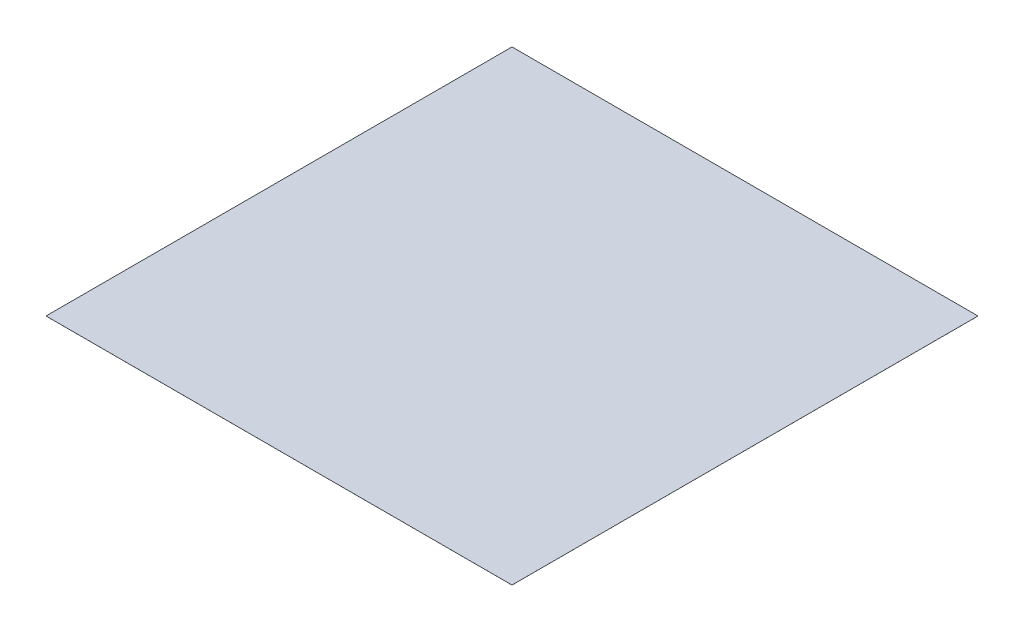
ISO-10303-21;
HEADER;
FILE_DESCRIPTION(('STEP AP214'),'2;1');
FILE_NAME('part.step','',(''),(''),'','','');
FILE_SCHEMA(('AUTOMOTIVE_DESIGN { 1 0 10303 214 1 1 1 1 }'));
ENDSEC;
DATA;
#1=APPLICATION_CONTEXT('core data for automotive mechanical design processes');
#2=APPLICATION_PROTOCOL_DEFINITION('international standard','automotive_design',2000,#1);
#3=PRODUCT_CONTEXT('',#1,'mechanical');
#4=PRODUCT('Part','Part','',(#3));
#5=PRODUCT_RELATED_PRODUCT_CATEGORY('part','',(#4));
#6=PRODUCT_DEFINITION_FORMATION('','',#4);
#7=PRODUCT_DEFINITION_CONTEXT('part definition',#1,'design');
#8=PRODUCT_DEFINITION('design','',#6,#7);
#9=PRODUCT_DEFINITION_SHAPE('','',#8);
#10=(LENGTH_UNIT() NAMED_UNIT(*) SI_UNIT(.MILLI.,.METRE.));
#11=(NAMED_UNIT(*) PLANE_ANGLE_UNIT() SI_UNIT($,.RADIAN.));
#12=(NAMED_UNIT(*) SI_UNIT($,.STERADIAN.) SOLID_ANGLE_UNIT());
#13=UNCERTAINTY_MEASURE_WITH_UNIT(LENGTH_MEASURE(1.E-05),#10,'distance_accuracy_value','');
#14=(GEOMETRIC_REPRESENTATION_CONTEXT(3) GLOBAL_UNCERTAINTY_ASSIGNED_CONTEXT((#13)) GLOBAL_UNIT_ASSIGNED_CONTEXT((#10,
#11,#12)) REPRESENTATION_CONTEXT('',''));
#15=CARTESIAN_POINT('',(0.,0.,0.));
#16=DIRECTION('',(0.,0.,1.));
#17=DIRECTION('',(1.,0.,0.));
#18=AXIS2_PLACEMENT_3D('',#15,#16,#17);
#19=CARTESIAN_POINT('',(125000.,10.,-125000.));
#20=DIRECTION('',(-1.,0.,0.));
#21=DIRECTION('',(0.,0.,1.));
#22=AXIS2_PLACEMENT_3D('',#19,#20,#21);
#23=PLANE('',#22);
#24=DIRECTION('',(0.,0.,-1.));
#25=VECTOR('',#24,1.);
#26=CARTESIAN_POINT('',(125000.,0.,-125000.));
#27=LINE('',#26,#25);
#28=CARTESIAN_POINT('',(125000.,0.,125000.));
#29=VERTEX_POINT('',#28);
#30=CARTESIAN_POINT('',(125000.,0.,-125000.));
#31=VERTEX_POINT('',#30);
#32=EDGE_CURVE('E96',#29,#31,#27,.T.);
#33=ORIENTED_EDGE('',*,*,#32,.T.);
#34=DIRECTION('',(0.,-1.,0.));
#35=VECTOR('',#34,1.);
#36=CARTESIAN_POINT('',(125000.,10.,-125000.));
#37=LINE('',#36,#35);
#38=CARTESIAN_POINT('',(125000.,10.,-125000.));
#39=VERTEX_POINT('',#38);
#40=EDGE_CURVE('E11',#39,#31,#37,.T.);
#41=ORIENTED_EDGE('',*,*,#40,.F.);
#42=DIRECTION('',(0.,0.,-1.));
#43=VECTOR('',#42,1.);
#44=CARTESIAN_POINT('',(125000.,10.,-125000.));
#45=LINE('',#44,#43);
#46=CARTESIAN_POINT('',(125000.,10.,125000.));
#47=VERTEX_POINT('',#46);
#48=EDGE_CURVE('E84',#47,#39,#45,.T.);
#49=ORIENTED_EDGE('',*,*,#48,.F.);
#50=DIRECTION('',(0.,-1.,0.));
#51=VECTOR('',#50,1.);
#52=CARTESIAN_POINT('',(125000.,10.,125000.));
#53=LINE('',#52,#51);
#54=EDGE_CURVE('E92',#47,#29,#53,.T.);
#55=ORIENTED_EDGE('',*,*,#54,.T.);
#56=EDGE_LOOP('',(#33,#41,#49,#55));
#57=FACE_BOUND('',#56,.T.);
#58=ADVANCED_FACE('F33',(#57),#23,.F.);
#59=CARTESIAN_POINT('',(-125000.,10.,-125000.));
#60=DIRECTION('',(0.,0.,1.));
#61=DIRECTION('',(1.,0.,0.));
#62=AXIS2_PLACEMENT_3D('',#59,#60,#61);
#63=PLANE('',#62);
#64=DIRECTION('',(-1.,0.,0.));
#65=VECTOR('',#64,1.);
#66=CARTESIAN_POINT('',(-125000.,0.,-125000.));
#67=LINE('',#66,#65);
#68=CARTESIAN_POINT('',(-125000.,0.,-125000.));
#69=VERTEX_POINT('',#68);
#70=EDGE_CURVE('E88',#31,#69,#67,.T.);
#71=ORIENTED_EDGE('',*,*,#70,.T.);
#72=DIRECTION('',(0.,-1.,0.));
#73=VECTOR('',#72,1.);
#74=CARTESIAN_POINT('',(-125000.,10.,-125000.));
#75=LINE('',#74,#73);
#76=CARTESIAN_POINT('',(-125000.,10.,-125000.));
#77=VERTEX_POINT('',#76);
#78=EDGE_CURVE('E41',#77,#69,#75,.T.);
#79=ORIENTED_EDGE('',*,*,#78,.F.);
#80=DIRECTION('',(-1.,0.,0.));
#81=VECTOR('',#80,1.);
#82=CARTESIAN_POINT('',(-125000.,10.,-125000.));
#83=LINE('',#82,#81);
#84=EDGE_CURVE('E79',#39,#77,#83,.T.);
#85=ORIENTED_EDGE('',*,*,#84,.F.);
#86=ORIENTED_EDGE('',*,*,#40,.T.);
#87=EDGE_LOOP('',(#71,#79,#85,#86));
#88=FACE_BOUND('',#87,.T.);
#89=ADVANCED_FACE('F87',(#88),#63,.F.);
#90=CARTESIAN_POINT('',(-125000.,10.,-125000.));
#91=DIRECTION('',(1.,0.,0.));
#92=DIRECTION('',(0.,0.,-1.));
#93=AXIS2_PLACEMENT_3D('',#90,#91,#92);
#94=PLANE('',#93);
#95=DIRECTION('',(0.,0.,1.));
#96=VECTOR('',#95,1.);
#97=CARTESIAN_POINT('',(-125000.,0.,-125000.));
#98=LINE('',#97,#96);
#99=CARTESIAN_POINT('',(-125000.,0.,125000.));
#100=VERTEX_POINT('',#99);
#101=EDGE_CURVE('E66',#69,#100,#98,.T.);
#102=ORIENTED_EDGE('',*,*,#101,.T.);
#103=DIRECTION('',(0.,-1.,0.));
#104=VECTOR('',#103,1.);
#105=CARTESIAN_POINT('',(-125000.,10.,125000.));
#106=LINE('',#105,#104);
#107=CARTESIAN_POINT('',(-125000.,10.,125000.));
#108=VERTEX_POINT('',#107);
#109=EDGE_CURVE('E89',#108,#100,#106,.T.);
#110=ORIENTED_EDGE('',*,*,#109,.F.);
#111=DIRECTION('',(0.,0.,1.));
#112=VECTOR('',#111,1.);
#113=CARTESIAN_POINT('',(-125000.,10.,-125000.));
#114=LINE('',#113,#112);
#115=EDGE_CURVE('E82',#77,#108,#114,.T.);
#116=ORIENTED_EDGE('',*,*,#115,.F.);
#117=ORIENTED_EDGE('',*,*,#78,.T.);
#118=EDGE_LOOP('',(#102,#110,#116,#117));
#119=FACE_BOUND('',#118,.T.);
#120=ADVANCED_FACE('F90',(#119),#94,.F.);
#121=CARTESIAN_POINT('',(-125000.,10.,125000.));
#122=DIRECTION('',(0.,0.,-1.));
#123=DIRECTION('',(-1.,0.,0.));
#124=AXIS2_PLACEMENT_3D('',#121,#122,#123);
#125=PLANE('',#124);
#126=DIRECTION('',(1.,0.,0.));
#127=VECTOR('',#126,1.);
#128=CARTESIAN_POINT('',(-125000.,0.,125000.));
#129=LINE('',#128,#127);
#130=EDGE_CURVE('E72',#100,#29,#129,.T.);
#131=ORIENTED_EDGE('',*,*,#130,.T.);
#132=ORIENTED_EDGE('',*,*,#54,.F.);
#133=DIRECTION('',(1.,0.,0.));
#134=VECTOR('',#133,1.);
#135=CARTESIAN_POINT('',(-125000.,10.,125000.));
#136=LINE('',#135,#134);
#137=EDGE_CURVE('E49',#108,#47,#136,.T.);
#138=ORIENTED_EDGE('',*,*,#137,.F.);
#139=ORIENTED_EDGE('',*,*,#109,.T.);
#140=EDGE_LOOP('',(#131,#132,#138,#139));
#141=FACE_BOUND('',#140,.T.);
#142=ADVANCED_FACE('F103',(#141),#125,.F.);
#143=CARTESIAN_POINT('',(0.,10.,0.));
#144=DIRECTION('',(0.,1.,0.));
#145=DIRECTION('',(0.,0.,1.));
#146=AXIS2_PLACEMENT_3D('',#143,#144,#145);
#147=PLANE('',#146);
#148=ORIENTED_EDGE('',*,*,#48,.T.);
#149=ORIENTED_EDGE('',*,*,#84,.T.);
#150=ORIENTED_EDGE('',*,*,#115,.T.);
#151=ORIENTED_EDGE('',*,*,#137,.T.);
#152=EDGE_LOOP('',(#148,#149,#150,#151));
#153=FACE_BOUND('',#152,.T.);
#154=ADVANCED_FACE('F80',(#153),#147,.T.);
#155=CARTESIAN_POINT('',(0.,0.,0.));
#156=DIRECTION('',(0.,1.,0.));
#157=DIRECTION('',(0.,0.,1.));
#158=AXIS2_PLACEMENT_3D('',#155,#156,#157);
#159=PLANE('',#158);
#160=ORIENTED_EDGE('',*,*,#32,.F.);
#161=ORIENTED_EDGE('',*,*,#130,.F.);
#162=ORIENTED_EDGE('',*,*,#101,.F.);
#163=ORIENTED_EDGE('',*,*,#70,.F.);
#164=EDGE_LOOP('',(#160,#161,#162,#163));
#165=FACE_BOUND('',#164,.T.);
#166=ADVANCED_FACE('F106',(#165),#159,.F.);
#167=CLOSED_SHELL('',(#58,#89,#120,#142,#154,#166));
#168=MANIFOLD_SOLID_BREP('B2',#167);
#169=ADVANCED_BREP_SHAPE_REPRESENTATION('',(#18,#168),#14);
#170=SHAPE_DEFINITION_REPRESENTATION(#9,#169);
ENDSEC;
END-ISO-10303-21;
